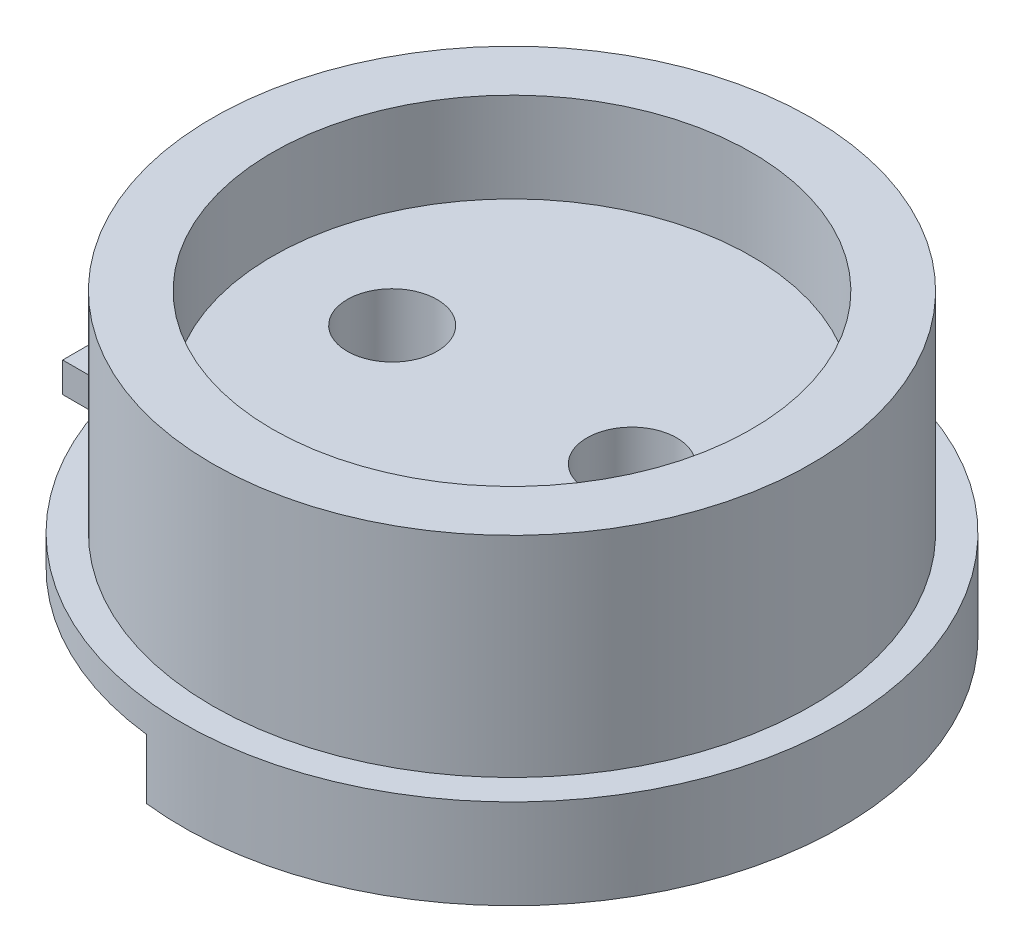
ISO-10303-21;
HEADER;
FILE_DESCRIPTION(('STEP AP214'),'2;1');
FILE_NAME('part.step','',(''),(''),'','','');
FILE_SCHEMA(('AUTOMOTIVE_DESIGN { 1 0 10303 214 1 1 1 1 }'));
ENDSEC;
DATA;
#1=APPLICATION_CONTEXT('core data for automotive mechanical design processes');
#2=APPLICATION_PROTOCOL_DEFINITION('international standard','automotive_design',2000,#1);
#3=PRODUCT_CONTEXT('',#1,'mechanical');
#4=PRODUCT('Part','Part','',(#3));
#5=PRODUCT_RELATED_PRODUCT_CATEGORY('part','',(#4));
#6=PRODUCT_DEFINITION_FORMATION('','',#4);
#7=PRODUCT_DEFINITION_CONTEXT('part definition',#1,'design');
#8=PRODUCT_DEFINITION('design','',#6,#7);
#9=PRODUCT_DEFINITION_SHAPE('','',#8);
#10=(LENGTH_UNIT() NAMED_UNIT(*) SI_UNIT(.MILLI.,.METRE.));
#11=(NAMED_UNIT(*) PLANE_ANGLE_UNIT() SI_UNIT($,.RADIAN.));
#12=(NAMED_UNIT(*) SI_UNIT($,.STERADIAN.) SOLID_ANGLE_UNIT());
#13=UNCERTAINTY_MEASURE_WITH_UNIT(LENGTH_MEASURE(1.E-05),#10,'distance_accuracy_value','');
#14=(GEOMETRIC_REPRESENTATION_CONTEXT(3) GLOBAL_UNCERTAINTY_ASSIGNED_CONTEXT((#13)) GLOBAL_UNIT_ASSIGNED_CONTEXT((#10,
#11,#12)) REPRESENTATION_CONTEXT('',''));
#15=CARTESIAN_POINT('',(0.,0.,0.));
#16=DIRECTION('',(0.,0.,1.));
#17=DIRECTION('',(1.,0.,0.));
#18=AXIS2_PLACEMENT_3D('',#15,#16,#17);
#19=CARTESIAN_POINT('',(-4.,3.,0.));
#20=DIRECTION('',(0.,1.,0.));
#21=DIRECTION('',(0.,0.,1.));
#22=AXIS2_PLACEMENT_3D('',#19,#20,#21);
#23=CYLINDRICAL_SURFACE('',#22,1.5);
#24=CARTESIAN_POINT('',(-4.,30.,0.));
#25=DIRECTION('',(0.,-1.,0.));
#26=DIRECTION('',(0.,0.,-1.));
#27=AXIS2_PLACEMENT_3D('',#24,#25,#26);
#28=CIRCLE('',#27,1.5);
#29=CARTESIAN_POINT('',(-4.,30.,-1.5));
#30=VERTEX_POINT('',#29);
#31=EDGE_CURVE('E201',#30,#30,#28,.T.);
#32=ORIENTED_EDGE('',*,*,#31,.T.);
#33=EDGE_LOOP('',(#32));
#34=FACE_BOUND('',#33,.T.);
#35=CARTESIAN_POINT('',(-4.,35.,0.));
#36=DIRECTION('',(0.,1.,0.));
#37=DIRECTION('',(0.,0.,1.));
#38=AXIS2_PLACEMENT_3D('',#35,#36,#37);
#39=CIRCLE('',#38,1.5);
#40=CARTESIAN_POINT('',(-4.,35.,1.5));
#41=VERTEX_POINT('',#40);
#42=EDGE_CURVE('E156',#41,#41,#39,.F.);
#43=ORIENTED_EDGE('',*,*,#42,.F.);
#44=EDGE_LOOP('',(#43));
#45=FACE_BOUND('',#44,.T.);
#46=ADVANCED_FACE('F62',(#34,#45),#23,.F.);
#47=CARTESIAN_POINT('',(4.,3.,0.));
#48=DIRECTION('',(0.,1.,0.));
#49=DIRECTION('',(0.,0.,1.));
#50=AXIS2_PLACEMENT_3D('',#47,#48,#49);
#51=CYLINDRICAL_SURFACE('',#50,1.5);
#52=CARTESIAN_POINT('',(4.,30.,0.));
#53=DIRECTION('',(0.,-1.,0.));
#54=DIRECTION('',(0.,0.,-1.));
#55=AXIS2_PLACEMENT_3D('',#52,#53,#54);
#56=CIRCLE('',#55,1.5);
#57=CARTESIAN_POINT('',(4.,30.,-1.5));
#58=VERTEX_POINT('',#57);
#59=EDGE_CURVE('E173',#58,#58,#56,.T.);
#60=ORIENTED_EDGE('',*,*,#59,.T.);
#61=EDGE_LOOP('',(#60));
#62=FACE_BOUND('',#61,.T.);
#63=CARTESIAN_POINT('',(4.,35.,0.));
#64=DIRECTION('',(0.,1.,0.));
#65=DIRECTION('',(0.,0.,1.));
#66=AXIS2_PLACEMENT_3D('',#63,#64,#65);
#67=CIRCLE('',#66,1.5);
#68=CARTESIAN_POINT('',(4.,35.,1.5));
#69=VERTEX_POINT('',#68);
#70=EDGE_CURVE('E65',#69,#69,#67,.F.);
#71=ORIENTED_EDGE('',*,*,#70,.F.);
#72=EDGE_LOOP('',(#71));
#73=FACE_BOUND('',#72,.T.);
#74=ADVANCED_FACE('F240',(#62,#73),#51,.F.);
#75=CARTESIAN_POINT('',(0.,30.,0.));
#76=DIRECTION('',(0.,1.,0.));
#77=DIRECTION('',(0.,0.,1.));
#78=AXIS2_PLACEMENT_3D('',#75,#76,#77);
#79=CYLINDRICAL_SURFACE('',#78,11.);
#80=DIRECTION('',(0.,-1.,0.));
#81=VECTOR('',#80,1.);
#82=CARTESIAN_POINT('',(-1.27988524143818,30.,10.9252868964045));
#83=LINE('',#82,#81);
#84=CARTESIAN_POINT('',(-1.27988524143818,30.,10.9252868964045));
#85=VERTEX_POINT('',#84);
#86=CARTESIAN_POINT('',(-1.27988524143818,28.,10.9252868964045));
#87=VERTEX_POINT('',#86);
#88=EDGE_CURVE('E133',#85,#87,#83,.T.);
#89=ORIENTED_EDGE('',*,*,#88,.T.);
#90=CARTESIAN_POINT('',(0.,28.,0.));
#91=DIRECTION('',(0.,-1.,0.));
#92=DIRECTION('',(0.,0.,-1.));
#93=AXIS2_PLACEMENT_3D('',#90,#91,#92);
#94=CIRCLE('',#93,11.);
#95=CARTESIAN_POINT('',(-1.27988524143818,28.,-10.9252868964045));
#96=VERTEX_POINT('',#95);
#97=EDGE_CURVE('E171',#96,#87,#94,.T.);
#98=ORIENTED_EDGE('',*,*,#97,.F.);
#99=DIRECTION('',(0.,-1.,0.));
#100=VECTOR('',#99,1.);
#101=CARTESIAN_POINT('',(-1.27988524143818,30.,-10.9252868964045));
#102=LINE('',#101,#100);
#103=CARTESIAN_POINT('',(-1.27988524143818,30.,-10.9252868964045));
#104=VERTEX_POINT('',#103);
#105=EDGE_CURVE('E78',#104,#96,#102,.T.);
#106=ORIENTED_EDGE('',*,*,#105,.F.);
#107=CARTESIAN_POINT('',(0.,30.,0.));
#108=DIRECTION('',(0.,-1.,0.));
#109=DIRECTION('',(0.,0.,-1.));
#110=AXIS2_PLACEMENT_3D('',#107,#108,#109);
#111=CIRCLE('',#110,11.);
#112=CARTESIAN_POINT('',(-10.7121426428143,30.,-2.5));
#113=VERTEX_POINT('',#112);
#114=EDGE_CURVE('E141',#113,#104,#111,.T.);
#115=ORIENTED_EDGE('',*,*,#114,.F.);
#116=DIRECTION('',(0.,1.,0.));
#117=VECTOR('',#116,1.);
#118=CARTESIAN_POINT('',(-10.7121426428143,30.,-2.5));
#119=LINE('',#118,#117);
#120=CARTESIAN_POINT('',(-10.7121426428143,31.,-2.5));
#121=VERTEX_POINT('',#120);
#122=EDGE_CURVE('E184',#113,#121,#119,.T.);
#123=ORIENTED_EDGE('',*,*,#122,.T.);
#124=CARTESIAN_POINT('',(0.,31.,0.));
#125=DIRECTION('',(0.,-1.,0.));
#126=DIRECTION('',(0.,0.,-1.));
#127=AXIS2_PLACEMENT_3D('',#124,#125,#126);
#128=CIRCLE('',#127,11.);
#129=CARTESIAN_POINT('',(-10.7121426428143,31.,2.5));
#130=VERTEX_POINT('',#129);
#131=EDGE_CURVE('E142',#121,#130,#128,.T.);
#132=ORIENTED_EDGE('',*,*,#131,.T.);
#133=DIRECTION('',(0.,1.,0.));
#134=VECTOR('',#133,1.);
#135=CARTESIAN_POINT('',(-10.7121426428143,30.,2.5));
#136=LINE('',#135,#134);
#137=CARTESIAN_POINT('',(-10.7121426428143,30.,2.5));
#138=VERTEX_POINT('',#137);
#139=EDGE_CURVE('E136',#138,#130,#136,.T.);
#140=ORIENTED_EDGE('',*,*,#139,.F.);
#141=EDGE_CURVE('E129',#85,#138,#111,.T.);
#142=ORIENTED_EDGE('',*,*,#141,.F.);
#143=EDGE_LOOP('',(#89,#98,#106,#115,#123,#132,#140,#142));
#144=FACE_BOUND('',#143,.T.);
#145=ADVANCED_FACE('F131',(#144),#79,.T.);
#146=CARTESIAN_POINT('',(-2.5,28.,0.));
#147=DIRECTION('',(0.,1.,0.));
#148=DIRECTION('',(0.,0.,1.));
#149=AXIS2_PLACEMENT_3D('',#146,#147,#148);
#150=CYLINDRICAL_SURFACE('',#149,10.);
#151=CARTESIAN_POINT('',(-2.5,28.,0.));
#152=DIRECTION('',(0.,-1.,0.));
#153=DIRECTION('',(0.,0.,-1.));
#154=AXIS2_PLACEMENT_3D('',#151,#152,#153);
#155=CIRCLE('',#154,10.);
#156=CARTESIAN_POINT('',(-1.27988524143818,28.,-9.92528689640454));
#157=VERTEX_POINT('',#156);
#158=CARTESIAN_POINT('',(-1.27988524143818,28.,9.92528689640454));
#159=VERTEX_POINT('',#158);
#160=EDGE_CURVE('E168',#157,#159,#155,.T.);
#161=ORIENTED_EDGE('',*,*,#160,.T.);
#162=DIRECTION('',(0.,-1.,0.));
#163=VECTOR('',#162,1.);
#164=CARTESIAN_POINT('',(-1.27988524143818,30.,9.92528689640454));
#165=LINE('',#164,#163);
#166=CARTESIAN_POINT('',(-1.27988524143818,30.,9.92528689640454));
#167=VERTEX_POINT('',#166);
#168=EDGE_CURVE('E86',#167,#159,#165,.T.);
#169=ORIENTED_EDGE('',*,*,#168,.F.);
#170=CARTESIAN_POINT('',(-2.5,30.,0.));
#171=DIRECTION('',(0.,-1.,0.));
#172=DIRECTION('',(0.,0.,-1.));
#173=AXIS2_PLACEMENT_3D('',#170,#171,#172);
#174=CIRCLE('',#173,10.);
#175=CARTESIAN_POINT('',(-1.27988524143818,30.,-9.92528689640454));
#176=VERTEX_POINT('',#175);
#177=EDGE_CURVE('E152',#176,#167,#174,.T.);
#178=ORIENTED_EDGE('',*,*,#177,.F.);
#179=DIRECTION('',(0.,-1.,0.));
#180=VECTOR('',#179,1.);
#181=CARTESIAN_POINT('',(-1.27988524143818,30.,-9.92528689640454));
#182=LINE('',#181,#180);
#183=EDGE_CURVE('E162',#176,#157,#182,.T.);
#184=ORIENTED_EDGE('',*,*,#183,.T.);
#185=EDGE_LOOP('',(#161,#169,#178,#184));
#186=FACE_BOUND('',#185,.T.);
#187=ADVANCED_FACE('F232',(#186),#150,.F.);
#188=CARTESIAN_POINT('',(0.,28.,0.));
#189=DIRECTION('',(0.,-1.,0.));
#190=DIRECTION('',(0.,0.,-1.));
#191=AXIS2_PLACEMENT_3D('',#188,#189,#190);
#192=PLANE('',#191);
#193=ORIENTED_EDGE('',*,*,#97,.T.);
#194=DIRECTION('',(0.,0.,-1.));
#195=VECTOR('',#194,1.);
#196=CARTESIAN_POINT('',(-1.27988524143818,28.,0.));
#197=LINE('',#196,#195);
#198=EDGE_CURVE('E146',#87,#159,#197,.T.);
#199=ORIENTED_EDGE('',*,*,#198,.T.);
#200=ORIENTED_EDGE('',*,*,#160,.F.);
#201=DIRECTION('',(0.,0.,-1.));
#202=VECTOR('',#201,1.);
#203=CARTESIAN_POINT('',(-1.27988524143818,28.,0.));
#204=LINE('',#203,#202);
#205=EDGE_CURVE('E163',#157,#96,#204,.T.);
#206=ORIENTED_EDGE('',*,*,#205,.T.);
#207=EDGE_LOOP('',(#193,#199,#200,#206));
#208=FACE_BOUND('',#207,.T.);
#209=ADVANCED_FACE('F229',(#208),#192,.T.);
#210=CARTESIAN_POINT('',(0.,30.,0.));
#211=DIRECTION('',(0.,-1.,0.));
#212=DIRECTION('',(0.,0.,-1.));
#213=AXIS2_PLACEMENT_3D('',#210,#211,#212);
#214=PLANE('',#213);
#215=ORIENTED_EDGE('',*,*,#31,.F.);
#216=EDGE_LOOP('',(#215));
#217=FACE_BOUND('',#216,.T.);
#218=ORIENTED_EDGE('',*,*,#59,.F.);
#219=EDGE_LOOP('',(#218));
#220=FACE_BOUND('',#219,.T.);
#221=ORIENTED_EDGE('',*,*,#114,.T.);
#222=DIRECTION('',(0.,0.,-1.));
#223=VECTOR('',#222,1.);
#224=CARTESIAN_POINT('',(-1.27988524143818,30.,0.));
#225=LINE('',#224,#223);
#226=EDGE_CURVE('E160',#176,#104,#225,.T.);
#227=ORIENTED_EDGE('',*,*,#226,.F.);
#228=ORIENTED_EDGE('',*,*,#177,.T.);
#229=DIRECTION('',(0.,0.,-1.));
#230=VECTOR('',#229,1.);
#231=CARTESIAN_POINT('',(-1.27988524143818,30.,0.));
#232=LINE('',#231,#230);
#233=EDGE_CURVE('E145',#85,#167,#232,.T.);
#234=ORIENTED_EDGE('',*,*,#233,.F.);
#235=ORIENTED_EDGE('',*,*,#141,.T.);
#236=DIRECTION('',(1.,0.,0.));
#237=VECTOR('',#236,1.);
#238=CARTESIAN_POINT('',(0.,30.,2.5));
#239=LINE('',#238,#237);
#240=CARTESIAN_POINT('',(-12.5,30.,2.5));
#241=VERTEX_POINT('',#240);
#242=EDGE_CURVE('E175',#241,#138,#239,.T.);
#243=ORIENTED_EDGE('',*,*,#242,.F.);
#244=DIRECTION('',(0.,0.,1.));
#245=VECTOR('',#244,1.);
#246=CARTESIAN_POINT('',(-12.5,30.,0.));
#247=LINE('',#246,#245);
#248=CARTESIAN_POINT('',(-12.5,30.,-2.5));
#249=VERTEX_POINT('',#248);
#250=EDGE_CURVE('E177',#249,#241,#247,.T.);
#251=ORIENTED_EDGE('',*,*,#250,.F.);
#252=DIRECTION('',(1.,0.,0.));
#253=VECTOR('',#252,1.);
#254=CARTESIAN_POINT('',(0.,30.,-2.5));
#255=LINE('',#254,#253);
#256=EDGE_CURVE('E181',#249,#113,#255,.T.);
#257=ORIENTED_EDGE('',*,*,#256,.T.);
#258=EDGE_LOOP('',(#221,#227,#228,#234,#235,#243,#251,#257));
#259=FACE_BOUND('',#258,.T.);
#260=ADVANCED_FACE('F149',(#217,#220,#259),#214,.T.);
#261=CARTESIAN_POINT('',(0.,38.,0.));
#262=DIRECTION('',(0.,1.,0.));
#263=DIRECTION('',(0.,0.,1.));
#264=AXIS2_PLACEMENT_3D('',#261,#262,#263);
#265=PLANE('',#264);
#266=CARTESIAN_POINT('',(0.,38.,0.));
#267=DIRECTION('',(0.,1.,0.));
#268=DIRECTION('',(0.,0.,1.));
#269=AXIS2_PLACEMENT_3D('',#266,#267,#268);
#270=CIRCLE('',#269,8.);
#271=CARTESIAN_POINT('',(0.,38.,8.));
#272=VERTEX_POINT('',#271);
#273=EDGE_CURVE('E259',#272,#272,#270,.T.);
#274=ORIENTED_EDGE('',*,*,#273,.F.);
#275=EDGE_LOOP('',(#274));
#276=FACE_BOUND('',#275,.T.);
#277=CARTESIAN_POINT('',(0.,38.,0.));
#278=DIRECTION('',(0.,1.,0.));
#279=DIRECTION('',(0.,0.,1.));
#280=AXIS2_PLACEMENT_3D('',#277,#278,#279);
#281=CIRCLE('',#280,10.);
#282=CARTESIAN_POINT('',(0.,38.,10.));
#283=VERTEX_POINT('',#282);
#284=EDGE_CURVE('E12',#283,#283,#281,.T.);
#285=ORIENTED_EDGE('',*,*,#284,.T.);
#286=EDGE_LOOP('',(#285));
#287=FACE_BOUND('',#286,.T.);
#288=ADVANCED_FACE('F268',(#276,#287),#265,.T.);
#289=CARTESIAN_POINT('',(0.,38.,0.));
#290=DIRECTION('',(0.,-1.,0.));
#291=DIRECTION('',(0.,0.,-1.));
#292=AXIS2_PLACEMENT_3D('',#289,#290,#291);
#293=CYLINDRICAL_SURFACE('',#292,10.);
#294=CARTESIAN_POINT('',(0.,31.,0.));
#295=DIRECTION('',(0.,1.,0.));
#296=DIRECTION('',(0.,0.,1.));
#297=AXIS2_PLACEMENT_3D('',#294,#295,#296);
#298=CIRCLE('',#297,10.);
#299=CARTESIAN_POINT('',(0.,31.,10.));
#300=VERTEX_POINT('',#299);
#301=EDGE_CURVE('E70',#300,#300,#298,.T.);
#302=ORIENTED_EDGE('',*,*,#301,.T.);
#303=EDGE_LOOP('',(#302));
#304=FACE_BOUND('',#303,.T.);
#305=ORIENTED_EDGE('',*,*,#284,.F.);
#306=EDGE_LOOP('',(#305));
#307=FACE_BOUND('',#306,.T.);
#308=ADVANCED_FACE('F207',(#304,#307),#293,.T.);
#309=CARTESIAN_POINT('',(0.,30.,2.5));
#310=DIRECTION('',(0.,0.,1.));
#311=DIRECTION('',(1.,0.,0.));
#312=AXIS2_PLACEMENT_3D('',#309,#310,#311);
#313=PLANE('',#312);
#314=DIRECTION('',(1.,0.,0.));
#315=VECTOR('',#314,1.);
#316=CARTESIAN_POINT('',(0.,31.,2.5));
#317=LINE('',#316,#315);
#318=CARTESIAN_POINT('',(-12.5,31.,2.5));
#319=VERTEX_POINT('',#318);
#320=EDGE_CURVE('E185',#319,#130,#317,.T.);
#321=ORIENTED_EDGE('',*,*,#320,.F.);
#322=DIRECTION('',(0.,1.,0.));
#323=VECTOR('',#322,1.);
#324=CARTESIAN_POINT('',(-12.5,30.,2.5));
#325=LINE('',#324,#323);
#326=EDGE_CURVE('E196',#241,#319,#325,.T.);
#327=ORIENTED_EDGE('',*,*,#326,.F.);
#328=ORIENTED_EDGE('',*,*,#242,.T.);
#329=ORIENTED_EDGE('',*,*,#139,.T.);
#330=EDGE_LOOP('',(#321,#327,#328,#329));
#331=FACE_BOUND('',#330,.T.);
#332=ADVANCED_FACE('F221',(#331),#313,.T.);
#333=CARTESIAN_POINT('',(-12.5,30.,0.));
#334=DIRECTION('',(-1.,0.,0.));
#335=DIRECTION('',(0.,0.,1.));
#336=AXIS2_PLACEMENT_3D('',#333,#334,#335);
#337=PLANE('',#336);
#338=DIRECTION('',(0.,0.,1.));
#339=VECTOR('',#338,1.);
#340=CARTESIAN_POINT('',(-12.5,31.,0.));
#341=LINE('',#340,#339);
#342=CARTESIAN_POINT('',(-12.5,31.,-2.5));
#343=VERTEX_POINT('',#342);
#344=EDGE_CURVE('E188',#343,#319,#341,.T.);
#345=ORIENTED_EDGE('',*,*,#344,.F.);
#346=DIRECTION('',(0.,1.,0.));
#347=VECTOR('',#346,1.);
#348=CARTESIAN_POINT('',(-12.5,30.,-2.5));
#349=LINE('',#348,#347);
#350=EDGE_CURVE('E194',#249,#343,#349,.T.);
#351=ORIENTED_EDGE('',*,*,#350,.F.);
#352=ORIENTED_EDGE('',*,*,#250,.T.);
#353=ORIENTED_EDGE('',*,*,#326,.T.);
#354=EDGE_LOOP('',(#345,#351,#352,#353));
#355=FACE_BOUND('',#354,.T.);
#356=ADVANCED_FACE('F227',(#355),#337,.T.);
#357=CARTESIAN_POINT('',(0.,30.,-2.5));
#358=DIRECTION('',(0.,0.,1.));
#359=DIRECTION('',(1.,0.,0.));
#360=AXIS2_PLACEMENT_3D('',#357,#358,#359);
#361=PLANE('',#360);
#362=DIRECTION('',(1.,0.,0.));
#363=VECTOR('',#362,1.);
#364=CARTESIAN_POINT('',(0.,31.,-2.5));
#365=LINE('',#364,#363);
#366=EDGE_CURVE('E178',#343,#121,#365,.T.);
#367=ORIENTED_EDGE('',*,*,#366,.T.);
#368=ORIENTED_EDGE('',*,*,#122,.F.);
#369=ORIENTED_EDGE('',*,*,#256,.F.);
#370=ORIENTED_EDGE('',*,*,#350,.T.);
#371=EDGE_LOOP('',(#367,#368,#369,#370));
#372=FACE_BOUND('',#371,.T.);
#373=ADVANCED_FACE('F214',(#372),#361,.F.);
#374=CARTESIAN_POINT('',(0.,31.,0.));
#375=DIRECTION('',(0.,-1.,0.));
#376=DIRECTION('',(0.,0.,-1.));
#377=AXIS2_PLACEMENT_3D('',#374,#375,#376);
#378=PLANE('',#377);
#379=ORIENTED_EDGE('',*,*,#301,.F.);
#380=EDGE_LOOP('',(#379));
#381=FACE_BOUND('',#380,.T.);
#382=ORIENTED_EDGE('',*,*,#320,.T.);
#383=ORIENTED_EDGE('',*,*,#131,.F.);
#384=ORIENTED_EDGE('',*,*,#366,.F.);
#385=ORIENTED_EDGE('',*,*,#344,.T.);
#386=EDGE_LOOP('',(#382,#383,#384,#385));
#387=FACE_BOUND('',#386,.T.);
#388=ADVANCED_FACE('F210',(#381,#387),#378,.F.);
#389=CARTESIAN_POINT('',(-1.27988524143818,30.,0.));
#390=DIRECTION('',(-1.,0.,0.));
#391=DIRECTION('',(0.,0.,1.));
#392=AXIS2_PLACEMENT_3D('',#389,#390,#391);
#393=PLANE('',#392);
#394=ORIENTED_EDGE('',*,*,#205,.F.);
#395=ORIENTED_EDGE('',*,*,#183,.F.);
#396=ORIENTED_EDGE('',*,*,#226,.T.);
#397=ORIENTED_EDGE('',*,*,#105,.T.);
#398=EDGE_LOOP('',(#394,#395,#396,#397));
#399=FACE_BOUND('',#398,.T.);
#400=ADVANCED_FACE('F213',(#399),#393,.T.);
#401=CARTESIAN_POINT('',(-1.27988524143818,30.,0.));
#402=DIRECTION('',(-1.,0.,0.));
#403=DIRECTION('',(0.,0.,1.));
#404=AXIS2_PLACEMENT_3D('',#401,#402,#403);
#405=PLANE('',#404);
#406=ORIENTED_EDGE('',*,*,#198,.F.);
#407=ORIENTED_EDGE('',*,*,#88,.F.);
#408=ORIENTED_EDGE('',*,*,#233,.T.);
#409=ORIENTED_EDGE('',*,*,#168,.T.);
#410=EDGE_LOOP('',(#406,#407,#408,#409));
#411=FACE_BOUND('',#410,.T.);
#412=ADVANCED_FACE('F144',(#411),#405,.T.);
#413=CARTESIAN_POINT('',(0.,35.,0.));
#414=DIRECTION('',(0.,1.,0.));
#415=DIRECTION('',(0.,0.,1.));
#416=AXIS2_PLACEMENT_3D('',#413,#414,#415);
#417=PLANE('',#416);
#418=CARTESIAN_POINT('',(0.,35.,0.));
#419=DIRECTION('',(0.,1.,0.));
#420=DIRECTION('',(0.,0.,1.));
#421=AXIS2_PLACEMENT_3D('',#418,#419,#420);
#422=CIRCLE('',#421,8.);
#423=CARTESIAN_POINT('',(0.,35.,8.));
#424=VERTEX_POINT('',#423);
#425=EDGE_CURVE('E255',#424,#424,#422,.T.);
#426=ORIENTED_EDGE('',*,*,#425,.T.);
#427=EDGE_LOOP('',(#426));
#428=FACE_BOUND('',#427,.T.);
#429=ORIENTED_EDGE('',*,*,#70,.T.);
#430=EDGE_LOOP('',(#429));
#431=FACE_BOUND('',#430,.T.);
#432=ORIENTED_EDGE('',*,*,#42,.T.);
#433=EDGE_LOOP('',(#432));
#434=FACE_BOUND('',#433,.T.);
#435=ADVANCED_FACE('F308',(#428,#431,#434),#417,.T.);
#436=CARTESIAN_POINT('',(0.,35.,0.));
#437=DIRECTION('',(0.,1.,0.));
#438=DIRECTION('',(0.,0.,1.));
#439=AXIS2_PLACEMENT_3D('',#436,#437,#438);
#440=CYLINDRICAL_SURFACE('',#439,8.);
#441=ORIENTED_EDGE('',*,*,#425,.F.);
#442=EDGE_LOOP('',(#441));
#443=FACE_BOUND('',#442,.T.);
#444=ORIENTED_EDGE('',*,*,#273,.T.);
#445=EDGE_LOOP('',(#444));
#446=FACE_BOUND('',#445,.T.);
#447=ADVANCED_FACE('F266',(#443,#446),#440,.F.);
#448=CLOSED_SHELL('',(#46,#74,#145,#187,#209,#260,#288,#308,#332,#356,#373,#388,#400,#412,#435,#447));
#449=MANIFOLD_SOLID_BREP('B2',#448);
#450=ADVANCED_BREP_SHAPE_REPRESENTATION('',(#18,#449),#14);
#451=SHAPE_DEFINITION_REPRESENTATION(#9,#450);
ENDSEC;
END-ISO-10303-21;
